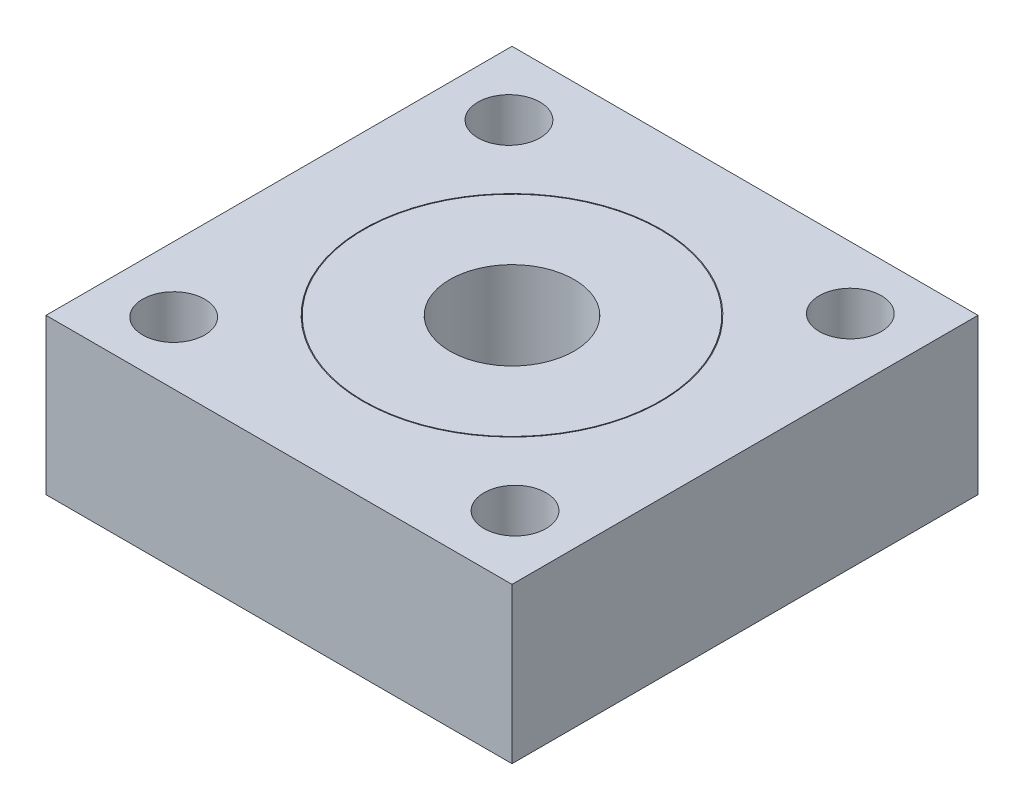
ISO-10303-21;
HEADER;
FILE_DESCRIPTION(('STEP AP214'),'2;1');
FILE_NAME('part.step','',(''),(''),'','','');
FILE_SCHEMA(('AUTOMOTIVE_DESIGN { 1 0 10303 214 1 1 1 1 }'));
ENDSEC;
DATA;
#1=APPLICATION_CONTEXT('core data for automotive mechanical design processes');
#2=APPLICATION_PROTOCOL_DEFINITION('international standard','automotive_design',2000,#1);
#3=PRODUCT_CONTEXT('',#1,'mechanical');
#4=PRODUCT('Part','Part','',(#3));
#5=PRODUCT_RELATED_PRODUCT_CATEGORY('part','',(#4));
#6=PRODUCT_DEFINITION_FORMATION('','',#4);
#7=PRODUCT_DEFINITION_CONTEXT('part definition',#1,'design');
#8=PRODUCT_DEFINITION('design','',#6,#7);
#9=PRODUCT_DEFINITION_SHAPE('','',#8);
#10=(LENGTH_UNIT() NAMED_UNIT(*) SI_UNIT(.MILLI.,.METRE.));
#11=(NAMED_UNIT(*) PLANE_ANGLE_UNIT() SI_UNIT($,.RADIAN.));
#12=(NAMED_UNIT(*) SI_UNIT($,.STERADIAN.) SOLID_ANGLE_UNIT());
#13=UNCERTAINTY_MEASURE_WITH_UNIT(LENGTH_MEASURE(1.E-05),#10,'distance_accuracy_value','');
#14=(GEOMETRIC_REPRESENTATION_CONTEXT(3) GLOBAL_UNCERTAINTY_ASSIGNED_CONTEXT((#13)) GLOBAL_UNIT_ASSIGNED_CONTEXT((#10,
#11,#12)) REPRESENTATION_CONTEXT('',''));
#15=CARTESIAN_POINT('',(0.,0.,0.));
#16=DIRECTION('',(0.,0.,1.));
#17=DIRECTION('',(1.,0.,0.));
#18=AXIS2_PLACEMENT_3D('',#15,#16,#17);
#19=CARTESIAN_POINT('',(15.,10.,-15.));
#20=DIRECTION('',(-1.,0.,0.));
#21=DIRECTION('',(0.,0.,1.));
#22=AXIS2_PLACEMENT_3D('',#19,#20,#21);
#23=PLANE('',#22);
#24=DIRECTION('',(0.,0.,-1.));
#25=VECTOR('',#24,1.);
#26=CARTESIAN_POINT('',(15.,0.,-15.));
#27=LINE('',#26,#25);
#28=CARTESIAN_POINT('',(15.,0.,15.));
#29=VERTEX_POINT('',#28);
#30=CARTESIAN_POINT('',(15.,0.,-15.));
#31=VERTEX_POINT('',#30);
#32=EDGE_CURVE('E107',#29,#31,#27,.T.);
#33=ORIENTED_EDGE('',*,*,#32,.T.);
#34=DIRECTION('',(0.,-1.,0.));
#35=VECTOR('',#34,1.);
#36=CARTESIAN_POINT('',(15.,10.,-15.));
#37=LINE('',#36,#35);
#38=CARTESIAN_POINT('',(15.,10.,-15.));
#39=VERTEX_POINT('',#38);
#40=EDGE_CURVE('E11',#39,#31,#37,.T.);
#41=ORIENTED_EDGE('',*,*,#40,.F.);
#42=DIRECTION('',(0.,0.,-1.));
#43=VECTOR('',#42,1.);
#44=CARTESIAN_POINT('',(15.,10.,-15.));
#45=LINE('',#44,#43);
#46=CARTESIAN_POINT('',(15.,10.,15.));
#47=VERTEX_POINT('',#46);
#48=EDGE_CURVE('E91',#47,#39,#45,.T.);
#49=ORIENTED_EDGE('',*,*,#48,.F.);
#50=DIRECTION('',(0.,-1.,0.));
#51=VECTOR('',#50,1.);
#52=CARTESIAN_POINT('',(15.,10.,15.));
#53=LINE('',#52,#51);
#54=EDGE_CURVE('E103',#47,#29,#53,.T.);
#55=ORIENTED_EDGE('',*,*,#54,.T.);
#56=EDGE_LOOP('',(#33,#41,#49,#55));
#57=FACE_BOUND('',#56,.T.);
#58=ADVANCED_FACE('F39',(#57),#23,.F.);
#59=CARTESIAN_POINT('',(-15.,10.,-15.));
#60=DIRECTION('',(0.,0.,1.));
#61=DIRECTION('',(1.,0.,0.));
#62=AXIS2_PLACEMENT_3D('',#59,#60,#61);
#63=PLANE('',#62);
#64=DIRECTION('',(-1.,0.,0.));
#65=VECTOR('',#64,1.);
#66=CARTESIAN_POINT('',(-15.,0.,-15.));
#67=LINE('',#66,#65);
#68=CARTESIAN_POINT('',(-15.,0.,-15.));
#69=VERTEX_POINT('',#68);
#70=EDGE_CURVE('E96',#31,#69,#67,.T.);
#71=ORIENTED_EDGE('',*,*,#70,.T.);
#72=DIRECTION('',(0.,-1.,0.));
#73=VECTOR('',#72,1.);
#74=CARTESIAN_POINT('',(-15.,10.,-15.));
#75=LINE('',#74,#73);
#76=CARTESIAN_POINT('',(-15.,10.,-15.));
#77=VERTEX_POINT('',#76);
#78=EDGE_CURVE('E48',#77,#69,#75,.T.);
#79=ORIENTED_EDGE('',*,*,#78,.F.);
#80=DIRECTION('',(-1.,0.,0.));
#81=VECTOR('',#80,1.);
#82=CARTESIAN_POINT('',(-15.,10.,-15.));
#83=LINE('',#82,#81);
#84=EDGE_CURVE('E86',#39,#77,#83,.T.);
#85=ORIENTED_EDGE('',*,*,#84,.F.);
#86=ORIENTED_EDGE('',*,*,#40,.T.);
#87=EDGE_LOOP('',(#71,#79,#85,#86));
#88=FACE_BOUND('',#87,.T.);
#89=ADVANCED_FACE('F95',(#88),#63,.F.);
#90=CARTESIAN_POINT('',(-15.,10.,-15.));
#91=DIRECTION('',(1.,0.,0.));
#92=DIRECTION('',(0.,0.,-1.));
#93=AXIS2_PLACEMENT_3D('',#90,#91,#92);
#94=PLANE('',#93);
#95=DIRECTION('',(0.,0.,1.));
#96=VECTOR('',#95,1.);
#97=CARTESIAN_POINT('',(-15.,0.,-15.));
#98=LINE('',#97,#96);
#99=CARTESIAN_POINT('',(-15.,0.,15.));
#100=VERTEX_POINT('',#99);
#101=EDGE_CURVE('E73',#69,#100,#98,.T.);
#102=ORIENTED_EDGE('',*,*,#101,.T.);
#103=DIRECTION('',(0.,-1.,0.));
#104=VECTOR('',#103,1.);
#105=CARTESIAN_POINT('',(-15.,10.,15.));
#106=LINE('',#105,#104);
#107=CARTESIAN_POINT('',(-15.,10.,15.));
#108=VERTEX_POINT('',#107);
#109=EDGE_CURVE('E98',#108,#100,#106,.T.);
#110=ORIENTED_EDGE('',*,*,#109,.F.);
#111=DIRECTION('',(0.,0.,1.));
#112=VECTOR('',#111,1.);
#113=CARTESIAN_POINT('',(-15.,10.,-15.));
#114=LINE('',#113,#112);
#115=EDGE_CURVE('E89',#77,#108,#114,.T.);
#116=ORIENTED_EDGE('',*,*,#115,.F.);
#117=ORIENTED_EDGE('',*,*,#78,.T.);
#118=EDGE_LOOP('',(#102,#110,#116,#117));
#119=FACE_BOUND('',#118,.T.);
#120=ADVANCED_FACE('F99',(#119),#94,.F.);
#121=CARTESIAN_POINT('',(-15.,10.,15.));
#122=DIRECTION('',(0.,0.,-1.));
#123=DIRECTION('',(-1.,0.,0.));
#124=AXIS2_PLACEMENT_3D('',#121,#122,#123);
#125=PLANE('',#124);
#126=DIRECTION('',(1.,0.,0.));
#127=VECTOR('',#126,1.);
#128=CARTESIAN_POINT('',(-15.,0.,15.));
#129=LINE('',#128,#127);
#130=EDGE_CURVE('E79',#100,#29,#129,.T.);
#131=ORIENTED_EDGE('',*,*,#130,.T.);
#132=ORIENTED_EDGE('',*,*,#54,.F.);
#133=DIRECTION('',(1.,0.,0.));
#134=VECTOR('',#133,1.);
#135=CARTESIAN_POINT('',(-15.,10.,15.));
#136=LINE('',#135,#134);
#137=EDGE_CURVE('E56',#108,#47,#136,.T.);
#138=ORIENTED_EDGE('',*,*,#137,.F.);
#139=ORIENTED_EDGE('',*,*,#109,.T.);
#140=EDGE_LOOP('',(#131,#132,#138,#139));
#141=FACE_BOUND('',#140,.T.);
#142=ADVANCED_FACE('F121',(#141),#125,.F.);
#143=CARTESIAN_POINT('',(0.,10.,0.));
#144=DIRECTION('',(0.,1.,0.));
#145=DIRECTION('',(0.,0.,1.));
#146=AXIS2_PLACEMENT_3D('',#143,#144,#145);
#147=PLANE('',#146);
#148=CARTESIAN_POINT('',(-10.9875097580016,10.,-10.7923497267759));
#149=DIRECTION('',(0.,1.,0.));
#150=DIRECTION('',(1.,0.,0.));
#151=AXIS2_PLACEMENT_3D('',#148,#149,#150);
#152=CIRCLE('',#151,2.);
#153=CARTESIAN_POINT('',(-8.98750975800163,10.,-10.7923497267759));
#154=VERTEX_POINT('',#153);
#155=EDGE_CURVE('E156',#154,#154,#152,.T.);
#156=ORIENTED_EDGE('',*,*,#155,.F.);
#157=EDGE_LOOP('',(#156));
#158=FACE_BOUND('',#157,.T.);
#159=CARTESIAN_POINT('',(-10.792349726776,10.,10.9875097580016));
#160=DIRECTION('',(0.,1.,0.));
#161=DIRECTION('',(0.,0.,-1.));
#162=AXIS2_PLACEMENT_3D('',#159,#160,#161);
#163=CIRCLE('',#162,2.);
#164=CARTESIAN_POINT('',(-10.792349726776,10.,8.9875097580016));
#165=VERTEX_POINT('',#164);
#166=EDGE_CURVE('E169',#165,#165,#163,.T.);
#167=ORIENTED_EDGE('',*,*,#166,.F.);
#168=EDGE_LOOP('',(#167));
#169=FACE_BOUND('',#168,.T.);
#170=CARTESIAN_POINT('',(10.9875097580017,10.,10.7923497267758));
#171=DIRECTION('',(0.,1.,0.));
#172=DIRECTION('',(-1.,0.,0.));
#173=AXIS2_PLACEMENT_3D('',#170,#171,#172);
#174=CIRCLE('',#173,2.);
#175=CARTESIAN_POINT('',(8.98750975800171,10.,10.7923497267759));
#176=VERTEX_POINT('',#175);
#177=EDGE_CURVE('E160',#176,#176,#174,.T.);
#178=ORIENTED_EDGE('',*,*,#177,.F.);
#179=EDGE_LOOP('',(#178));
#180=FACE_BOUND('',#179,.T.);
#181=CARTESIAN_POINT('',(10.792349726776,10.,-10.9875097580016));
#182=DIRECTION('',(0.,1.,0.));
#183=DIRECTION('',(0.,0.,1.));
#184=AXIS2_PLACEMENT_3D('',#181,#182,#183);
#185=CIRCLE('',#184,2.);
#186=CARTESIAN_POINT('',(10.792349726776,10.,-8.9875097580016));
#187=VERTEX_POINT('',#186);
#188=EDGE_CURVE('E152',#187,#187,#185,.T.);
#189=ORIENTED_EDGE('',*,*,#188,.F.);
#190=EDGE_LOOP('',(#189));
#191=FACE_BOUND('',#190,.T.);
#192=CARTESIAN_POINT('',(0.,10.,0.));
#193=DIRECTION('',(0.,1.,0.));
#194=DIRECTION('',(0.,0.,1.));
#195=AXIS2_PLACEMENT_3D('',#192,#193,#194);
#196=CIRCLE('',#195,9.6);
#197=CARTESIAN_POINT('',(0.,10.,9.6));
#198=VERTEX_POINT('',#197);
#199=EDGE_CURVE('E128',#198,#198,#196,.T.);
#200=ORIENTED_EDGE('',*,*,#199,.F.);
#201=EDGE_LOOP('',(#200));
#202=FACE_BOUND('',#201,.T.);
#203=ORIENTED_EDGE('',*,*,#48,.T.);
#204=ORIENTED_EDGE('',*,*,#84,.T.);
#205=ORIENTED_EDGE('',*,*,#115,.T.);
#206=ORIENTED_EDGE('',*,*,#137,.T.);
#207=EDGE_LOOP('',(#203,#204,#205,#206));
#208=FACE_BOUND('',#207,.T.);
#209=ADVANCED_FACE('F87',(#158,#169,#180,#191,#202,#208),#147,.T.);
#210=CARTESIAN_POINT('',(0.,0.,0.));
#211=DIRECTION('',(0.,1.,0.));
#212=DIRECTION('',(0.,0.,1.));
#213=AXIS2_PLACEMENT_3D('',#210,#211,#212);
#214=PLANE('',#213);
#215=CARTESIAN_POINT('',(-10.9875097580016,0.,-10.7923497267759));
#216=DIRECTION('',(0.,1.,0.));
#217=DIRECTION('',(1.,0.,0.));
#218=AXIS2_PLACEMENT_3D('',#215,#216,#217);
#219=CIRCLE('',#218,2.);
#220=CARTESIAN_POINT('',(-8.98750975800163,0.,-10.7923497267759));
#221=VERTEX_POINT('',#220);
#222=EDGE_CURVE('E173',#221,#221,#219,.T.);
#223=ORIENTED_EDGE('',*,*,#222,.T.);
#224=EDGE_LOOP('',(#223));
#225=FACE_BOUND('',#224,.T.);
#226=CARTESIAN_POINT('',(-10.792349726776,0.,10.9875097580016));
#227=DIRECTION('',(0.,1.,0.));
#228=DIRECTION('',(0.,0.,-1.));
#229=AXIS2_PLACEMENT_3D('',#226,#227,#228);
#230=CIRCLE('',#229,2.);
#231=CARTESIAN_POINT('',(-10.792349726776,0.,8.9875097580016));
#232=VERTEX_POINT('',#231);
#233=EDGE_CURVE('E164',#232,#232,#230,.T.);
#234=ORIENTED_EDGE('',*,*,#233,.T.);
#235=EDGE_LOOP('',(#234));
#236=FACE_BOUND('',#235,.T.);
#237=CARTESIAN_POINT('',(10.9875097580017,0.,10.7923497267758));
#238=DIRECTION('',(0.,1.,0.));
#239=DIRECTION('',(-1.,0.,0.));
#240=AXIS2_PLACEMENT_3D('',#237,#238,#239);
#241=CIRCLE('',#240,2.);
#242=CARTESIAN_POINT('',(8.98750975800171,0.,10.7923497267759));
#243=VERTEX_POINT('',#242);
#244=EDGE_CURVE('E165',#243,#243,#241,.T.);
#245=ORIENTED_EDGE('',*,*,#244,.T.);
#246=EDGE_LOOP('',(#245));
#247=FACE_BOUND('',#246,.T.);
#248=CARTESIAN_POINT('',(10.792349726776,0.,-10.9875097580016));
#249=DIRECTION('',(0.,1.,0.));
#250=DIRECTION('',(0.,0.,1.));
#251=AXIS2_PLACEMENT_3D('',#248,#249,#250);
#252=CIRCLE('',#251,2.);
#253=CARTESIAN_POINT('',(10.792349726776,0.,-8.9875097580016));
#254=VERTEX_POINT('',#253);
#255=EDGE_CURVE('E148',#254,#254,#252,.T.);
#256=ORIENTED_EDGE('',*,*,#255,.T.);
#257=EDGE_LOOP('',(#256));
#258=FACE_BOUND('',#257,.T.);
#259=ORIENTED_EDGE('',*,*,#32,.F.);
#260=ORIENTED_EDGE('',*,*,#130,.F.);
#261=ORIENTED_EDGE('',*,*,#101,.F.);
#262=ORIENTED_EDGE('',*,*,#70,.F.);
#263=EDGE_LOOP('',(#259,#260,#261,#262));
#264=FACE_BOUND('',#263,.T.);
#265=ADVANCED_FACE('F124',(#225,#236,#247,#258,#264),#214,.F.);
#266=CARTESIAN_POINT('',(0.,3.,0.));
#267=DIRECTION('',(0.,1.,0.));
#268=DIRECTION('',(0.,0.,1.));
#269=AXIS2_PLACEMENT_3D('',#266,#267,#268);
#270=CYLINDRICAL_SURFACE('',#269,9.6);
#271=CARTESIAN_POINT('',(0.,3.,0.));
#272=DIRECTION('',(0.,1.,0.));
#273=DIRECTION('',(0.,0.,1.));
#274=AXIS2_PLACEMENT_3D('',#271,#272,#273);
#275=CIRCLE('',#274,9.6);
#276=CARTESIAN_POINT('',(0.,3.,9.6));
#277=VERTEX_POINT('',#276);
#278=EDGE_CURVE('E111',#277,#277,#275,.T.);
#279=ORIENTED_EDGE('',*,*,#278,.F.);
#280=EDGE_LOOP('',(#279));
#281=FACE_BOUND('',#280,.T.);
#282=ORIENTED_EDGE('',*,*,#199,.T.);
#283=EDGE_LOOP('',(#282));
#284=FACE_BOUND('',#283,.T.);
#285=ADVANCED_FACE('F205',(#281,#284),#270,.F.);
#286=CARTESIAN_POINT('',(0.,3.,0.));
#287=DIRECTION('',(0.,1.,0.));
#288=DIRECTION('',(0.,0.,1.));
#289=AXIS2_PLACEMENT_3D('',#286,#287,#288);
#290=PLANE('',#289);
#291=CARTESIAN_POINT('',(0.,3.,0.));
#292=DIRECTION('',(0.,1.,0.));
#293=DIRECTION('',(0.,0.,1.));
#294=AXIS2_PLACEMENT_3D('',#291,#292,#293);
#295=CIRCLE('',#294,9.55);
#296=CARTESIAN_POINT('',(0.,3.,9.55));
#297=VERTEX_POINT('',#296);
#298=EDGE_CURVE('E132',#297,#297,#295,.T.);
#299=ORIENTED_EDGE('',*,*,#298,.F.);
#300=EDGE_LOOP('',(#299));
#301=FACE_BOUND('',#300,.T.);
#302=ORIENTED_EDGE('',*,*,#278,.T.);
#303=EDGE_LOOP('',(#302));
#304=FACE_BOUND('',#303,.T.);
#305=ADVANCED_FACE('F207',(#301,#304),#290,.T.);
#306=CARTESIAN_POINT('',(0.,3.,0.));
#307=DIRECTION('',(0.,1.,0.));
#308=DIRECTION('',(0.,0.,1.));
#309=AXIS2_PLACEMENT_3D('',#306,#307,#308);
#310=CYLINDRICAL_SURFACE('',#309,9.55);
#311=ORIENTED_EDGE('',*,*,#298,.T.);
#312=EDGE_LOOP('',(#311));
#313=FACE_BOUND('',#312,.T.);
#314=CARTESIAN_POINT('',(0.,10.,0.));
#315=DIRECTION('',(0.,1.,0.));
#316=DIRECTION('',(0.,0.,1.));
#317=AXIS2_PLACEMENT_3D('',#314,#315,#316);
#318=CIRCLE('',#317,9.55);
#319=CARTESIAN_POINT('',(0.,10.,9.55));
#320=VERTEX_POINT('',#319);
#321=EDGE_CURVE('E136',#320,#320,#318,.T.);
#322=ORIENTED_EDGE('',*,*,#321,.F.);
#323=EDGE_LOOP('',(#322));
#324=FACE_BOUND('',#323,.T.);
#325=ADVANCED_FACE('F214',(#313,#324),#310,.T.);
#326=CARTESIAN_POINT('',(0.,10.,0.));
#327=DIRECTION('',(0.,1.,0.));
#328=DIRECTION('',(0.,0.,1.));
#329=AXIS2_PLACEMENT_3D('',#326,#327,#328);
#330=CIRCLE('',#329,4.);
#331=CARTESIAN_POINT('',(0.,10.,4.));
#332=VERTEX_POINT('',#331);
#333=EDGE_CURVE('E144',#332,#332,#330,.T.);
#334=ORIENTED_EDGE('',*,*,#333,.F.);
#335=EDGE_LOOP('',(#334));
#336=FACE_BOUND('',#335,.T.);
#337=ORIENTED_EDGE('',*,*,#321,.T.);
#338=EDGE_LOOP('',(#337));
#339=FACE_BOUND('',#338,.T.);
#340=ADVANCED_FACE('F196',(#336,#339),#147,.T.);
#341=CARTESIAN_POINT('',(0.,3.,0.));
#342=DIRECTION('',(0.,1.,0.));
#343=DIRECTION('',(0.,0.,1.));
#344=AXIS2_PLACEMENT_3D('',#341,#342,#343);
#345=CYLINDRICAL_SURFACE('',#344,4.);
#346=CARTESIAN_POINT('',(0.,3.,0.));
#347=DIRECTION('',(0.,1.,0.));
#348=DIRECTION('',(0.,0.,1.));
#349=AXIS2_PLACEMENT_3D('',#346,#347,#348);
#350=CIRCLE('',#349,4.);
#351=CARTESIAN_POINT('',(0.,3.,4.));
#352=VERTEX_POINT('',#351);
#353=EDGE_CURVE('E140',#352,#352,#350,.T.);
#354=ORIENTED_EDGE('',*,*,#353,.F.);
#355=EDGE_LOOP('',(#354));
#356=FACE_BOUND('',#355,.T.);
#357=ORIENTED_EDGE('',*,*,#333,.T.);
#358=EDGE_LOOP('',(#357));
#359=FACE_BOUND('',#358,.T.);
#360=ADVANCED_FACE('F283',(#356,#359),#345,.F.);
#361=CARTESIAN_POINT('',(0.,3.,0.));
#362=DIRECTION('',(0.,1.,0.));
#363=DIRECTION('',(0.,0.,1.));
#364=AXIS2_PLACEMENT_3D('',#361,#362,#363);
#365=PLANE('',#364);
#366=ORIENTED_EDGE('',*,*,#353,.T.);
#367=EDGE_LOOP('',(#366));
#368=FACE_BOUND('',#367,.T.);
#369=ADVANCED_FACE('F279',(#368),#365,.T.);
#370=CARTESIAN_POINT('',(10.792349726776,0.,-10.9875097580016));
#371=DIRECTION('',(0.,1.,0.));
#372=DIRECTION('',(0.,0.,1.));
#373=AXIS2_PLACEMENT_3D('',#370,#371,#372);
#374=CYLINDRICAL_SURFACE('',#373,2.);
#375=ORIENTED_EDGE('',*,*,#255,.F.);
#376=EDGE_LOOP('',(#375));
#377=FACE_BOUND('',#376,.T.);
#378=ORIENTED_EDGE('',*,*,#188,.T.);
#379=EDGE_LOOP('',(#378));
#380=FACE_BOUND('',#379,.T.);
#381=ADVANCED_FACE('F253',(#377,#380),#374,.F.);
#382=CARTESIAN_POINT('',(10.9875097580017,0.,10.7923497267758));
#383=DIRECTION('',(0.,1.,0.));
#384=DIRECTION('',(-1.,0.,0.));
#385=AXIS2_PLACEMENT_3D('',#382,#383,#384);
#386=CYLINDRICAL_SURFACE('',#385,2.);
#387=ORIENTED_EDGE('',*,*,#244,.F.);
#388=EDGE_LOOP('',(#387));
#389=FACE_BOUND('',#388,.T.);
#390=ORIENTED_EDGE('',*,*,#177,.T.);
#391=EDGE_LOOP('',(#390));
#392=FACE_BOUND('',#391,.T.);
#393=ADVANCED_FACE('F248',(#389,#392),#386,.F.);
#394=CARTESIAN_POINT('',(-10.792349726776,0.,10.9875097580016));
#395=DIRECTION('',(0.,1.,0.));
#396=DIRECTION('',(0.,0.,-1.));
#397=AXIS2_PLACEMENT_3D('',#394,#395,#396);
#398=CYLINDRICAL_SURFACE('',#397,2.);
#399=ORIENTED_EDGE('',*,*,#233,.F.);
#400=EDGE_LOOP('',(#399));
#401=FACE_BOUND('',#400,.T.);
#402=ORIENTED_EDGE('',*,*,#166,.T.);
#403=EDGE_LOOP('',(#402));
#404=FACE_BOUND('',#403,.T.);
#405=ADVANCED_FACE('F189',(#401,#404),#398,.F.);
#406=CARTESIAN_POINT('',(-10.9875097580016,0.,-10.7923497267759));
#407=DIRECTION('',(0.,1.,0.));
#408=DIRECTION('',(1.,0.,0.));
#409=AXIS2_PLACEMENT_3D('',#406,#407,#408);
#410=CYLINDRICAL_SURFACE('',#409,2.);
#411=ORIENTED_EDGE('',*,*,#222,.F.);
#412=EDGE_LOOP('',(#411));
#413=FACE_BOUND('',#412,.T.);
#414=ORIENTED_EDGE('',*,*,#155,.T.);
#415=EDGE_LOOP('',(#414));
#416=FACE_BOUND('',#415,.T.);
#417=ADVANCED_FACE('F186',(#413,#416),#410,.F.);
#418=CLOSED_SHELL('',(#58,#89,#120,#142,#209,#265,#285,#305,#325,#340,#360,#369,#381,#393,#405,#417));
#419=MANIFOLD_SOLID_BREP('B2',#418);
#420=ADVANCED_BREP_SHAPE_REPRESENTATION('',(#18,#419),#14);
#421=SHAPE_DEFINITION_REPRESENTATION(#9,#420);
ENDSEC;
END-ISO-10303-21;
